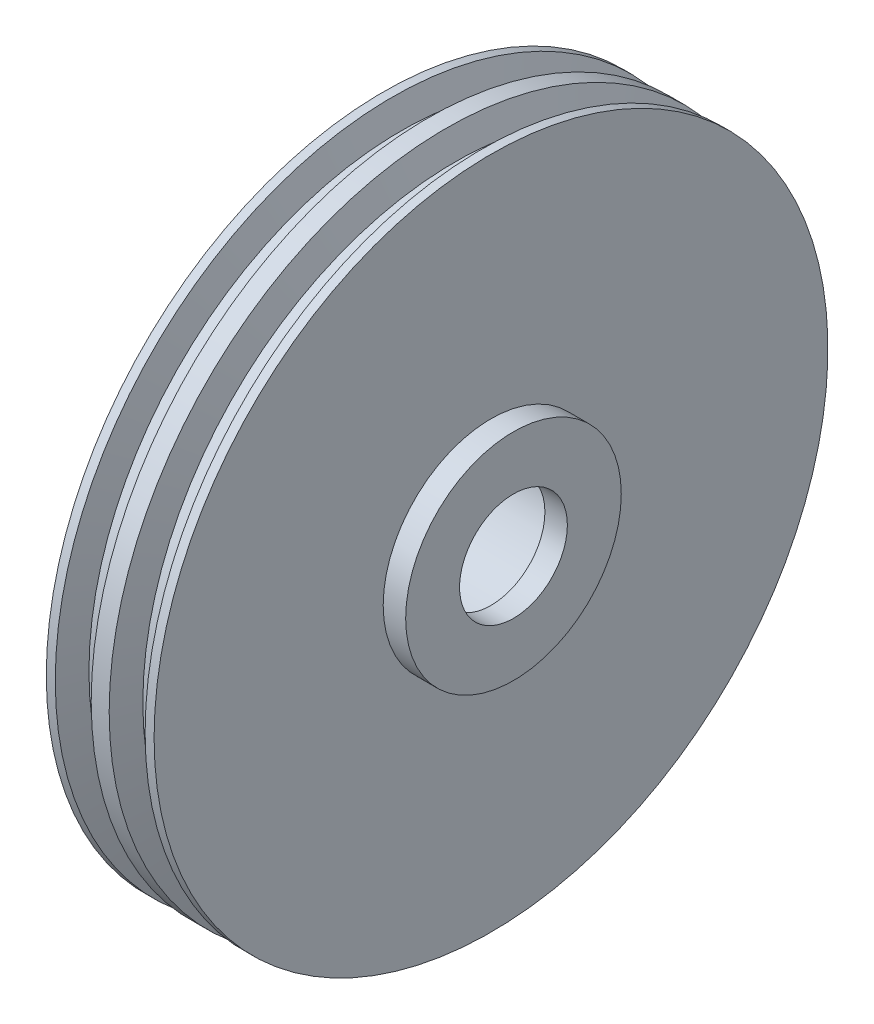
ISO-10303-21;
HEADER;
FILE_DESCRIPTION(('STEP AP214'),'2;1');
FILE_NAME('part.step','',(''),(''),'','','');
FILE_SCHEMA(('AUTOMOTIVE_DESIGN { 1 0 10303 214 1 1 1 1 }'));
ENDSEC;
DATA;
#1=APPLICATION_CONTEXT('core data for automotive mechanical design processes');
#2=APPLICATION_PROTOCOL_DEFINITION('international standard','automotive_design',2000,#1);
#3=PRODUCT_CONTEXT('',#1,'mechanical');
#4=PRODUCT('Part','Part','',(#3));
#5=PRODUCT_RELATED_PRODUCT_CATEGORY('part','',(#4));
#6=PRODUCT_DEFINITION_FORMATION('','',#4);
#7=PRODUCT_DEFINITION_CONTEXT('part definition',#1,'design');
#8=PRODUCT_DEFINITION('design','',#6,#7);
#9=PRODUCT_DEFINITION_SHAPE('','',#8);
#10=(LENGTH_UNIT() NAMED_UNIT(*) SI_UNIT(.MILLI.,.METRE.));
#11=(NAMED_UNIT(*) PLANE_ANGLE_UNIT() SI_UNIT($,.RADIAN.));
#12=(NAMED_UNIT(*) SI_UNIT($,.STERADIAN.) SOLID_ANGLE_UNIT());
#13=UNCERTAINTY_MEASURE_WITH_UNIT(LENGTH_MEASURE(1.E-05),#10,'distance_accuracy_value','');
#14=(GEOMETRIC_REPRESENTATION_CONTEXT(3) GLOBAL_UNCERTAINTY_ASSIGNED_CONTEXT((#13)) GLOBAL_UNIT_ASSIGNED_CONTEXT((#10,
#11,#12)) REPRESENTATION_CONTEXT('',''));
#15=CARTESIAN_POINT('',(0.,0.,0.));
#16=DIRECTION('',(0.,0.,1.));
#17=DIRECTION('',(1.,0.,0.));
#18=AXIS2_PLACEMENT_3D('',#15,#16,#17);
#19=CARTESIAN_POINT('',(0.,0.,0.));
#20=DIRECTION('',(-1.,0.,0.));
#21=DIRECTION('',(0.,0.,1.));
#22=AXIS2_PLACEMENT_3D('',#19,#20,#21);
#23=CYLINDRICAL_SURFACE('',#22,37.5);
#24=CARTESIAN_POINT('',(1.,0.,0.));
#25=DIRECTION('',(-1.,0.,0.));
#26=DIRECTION('',(0.,0.,1.));
#27=AXIS2_PLACEMENT_3D('',#24,#25,#26);
#28=CIRCLE('',#27,37.5);
#29=CARTESIAN_POINT('',(1.,0.,37.5));
#30=VERTEX_POINT('',#29);
#31=EDGE_CURVE('E37',#30,#30,#28,.T.);
#32=ORIENTED_EDGE('',*,*,#31,.T.);
#33=EDGE_LOOP('',(#32));
#34=FACE_BOUND('',#33,.T.);
#35=CARTESIAN_POINT('',(-1.,0.,0.));
#36=DIRECTION('',(-1.,0.,0.));
#37=DIRECTION('',(0.,0.,1.));
#38=AXIS2_PLACEMENT_3D('',#35,#36,#37);
#39=CIRCLE('',#38,37.5);
#40=CARTESIAN_POINT('',(-1.,0.,37.5));
#41=VERTEX_POINT('',#40);
#42=EDGE_CURVE('E71',#41,#41,#39,.T.);
#43=ORIENTED_EDGE('',*,*,#42,.F.);
#44=EDGE_LOOP('',(#43));
#45=FACE_BOUND('',#44,.T.);
#46=ADVANCED_FACE('F31',(#34,#45),#23,.T.);
#47=CARTESIAN_POINT('',(2.,0.,0.));
#48=DIRECTION('',(-1.,0.,0.));
#49=DIRECTION('',(0.,0.,1.));
#50=AXIS2_PLACEMENT_3D('',#47,#48,#49);
#51=CONICAL_SURFACE('',#50,34.7525225805454,1.22173047639603);
#52=ORIENTED_EDGE('',*,*,#31,.F.);
#53=EDGE_LOOP('',(#52));
#54=FACE_BOUND('',#53,.T.);
#55=CARTESIAN_POINT('',(2.,0.,0.));
#56=DIRECTION('',(-1.,0.,0.));
#57=DIRECTION('',(0.,0.,1.));
#58=AXIS2_PLACEMENT_3D('',#55,#56,#57);
#59=CIRCLE('',#58,34.7525225805454);
#60=CARTESIAN_POINT('',(2.,0.,34.7525225805454));
#61=VERTEX_POINT('',#60);
#62=EDGE_CURVE('E41',#61,#61,#59,.T.);
#63=ORIENTED_EDGE('',*,*,#62,.T.);
#64=EDGE_LOOP('',(#63));
#65=FACE_BOUND('',#64,.T.);
#66=ADVANCED_FACE('F134',(#54,#65),#51,.T.);
#67=CARTESIAN_POINT('',(0.,0.,0.));
#68=DIRECTION('',(-1.,0.,0.));
#69=DIRECTION('',(0.,0.,1.));
#70=AXIS2_PLACEMENT_3D('',#67,#68,#69);
#71=CYLINDRICAL_SURFACE('',#70,34.7525225805454);
#72=ORIENTED_EDGE('',*,*,#62,.F.);
#73=EDGE_LOOP('',(#72));
#74=FACE_BOUND('',#73,.T.);
#75=CARTESIAN_POINT('',(4.,0.,0.));
#76=DIRECTION('',(-1.,0.,0.));
#77=DIRECTION('',(0.,0.,1.));
#78=AXIS2_PLACEMENT_3D('',#75,#76,#77);
#79=CIRCLE('',#78,34.7525225805454);
#80=CARTESIAN_POINT('',(4.,0.,34.7525225805454));
#81=VERTEX_POINT('',#80);
#82=EDGE_CURVE('E45',#81,#81,#79,.T.);
#83=ORIENTED_EDGE('',*,*,#82,.T.);
#84=EDGE_LOOP('',(#83));
#85=FACE_BOUND('',#84,.T.);
#86=ADVANCED_FACE('F138',(#74,#85),#71,.T.);
#87=CARTESIAN_POINT('',(5.,0.,0.));
#88=DIRECTION('',(1.,0.,0.));
#89=DIRECTION('',(0.,0.,-1.));
#90=AXIS2_PLACEMENT_3D('',#87,#88,#89);
#91=CONICAL_SURFACE('',#90,37.5,1.22173047639603);
#92=ORIENTED_EDGE('',*,*,#82,.F.);
#93=EDGE_LOOP('',(#92));
#94=FACE_BOUND('',#93,.T.);
#95=CARTESIAN_POINT('',(5.,0.,0.));
#96=DIRECTION('',(-1.,0.,0.));
#97=DIRECTION('',(0.,0.,1.));
#98=AXIS2_PLACEMENT_3D('',#95,#96,#97);
#99=CIRCLE('',#98,37.5);
#100=CARTESIAN_POINT('',(5.,0.,37.5));
#101=VERTEX_POINT('',#100);
#102=EDGE_CURVE('E50',#101,#101,#99,.T.);
#103=ORIENTED_EDGE('',*,*,#102,.T.);
#104=EDGE_LOOP('',(#103));
#105=FACE_BOUND('',#104,.T.);
#106=ADVANCED_FACE('F288',(#94,#105),#91,.T.);
#107=CARTESIAN_POINT('',(0.,0.,0.));
#108=DIRECTION('',(-1.,0.,0.));
#109=DIRECTION('',(0.,0.,1.));
#110=AXIS2_PLACEMENT_3D('',#107,#108,#109);
#111=CYLINDRICAL_SURFACE('',#110,37.5);
#112=ORIENTED_EDGE('',*,*,#102,.F.);
#113=EDGE_LOOP('',(#112));
#114=FACE_BOUND('',#113,.T.);
#115=CARTESIAN_POINT('',(6.,0.,0.));
#116=DIRECTION('',(-1.,0.,0.));
#117=DIRECTION('',(0.,0.,1.));
#118=AXIS2_PLACEMENT_3D('',#115,#116,#117);
#119=CIRCLE('',#118,37.5);
#120=CARTESIAN_POINT('',(6.,0.,37.5));
#121=VERTEX_POINT('',#120);
#122=EDGE_CURVE('E53',#121,#121,#119,.T.);
#123=ORIENTED_EDGE('',*,*,#122,.T.);
#124=EDGE_LOOP('',(#123));
#125=FACE_BOUND('',#124,.T.);
#126=ADVANCED_FACE('F128',(#114,#125),#111,.T.);
#127=CARTESIAN_POINT('',(6.,37.5,0.));
#128=DIRECTION('',(-1.,0.,0.));
#129=DIRECTION('',(0.,0.,1.));
#130=AXIS2_PLACEMENT_3D('',#127,#128,#129);
#131=PLANE('',#130);
#132=CARTESIAN_POINT('',(6.,0.,0.));
#133=DIRECTION('',(-1.,0.,0.));
#134=DIRECTION('',(0.,0.,1.));
#135=AXIS2_PLACEMENT_3D('',#132,#133,#134);
#136=CIRCLE('',#135,12.);
#137=CARTESIAN_POINT('',(6.,0.,12.));
#138=VERTEX_POINT('',#137);
#139=EDGE_CURVE('E10',#138,#138,#136,.F.);
#140=ORIENTED_EDGE('',*,*,#139,.F.);
#141=EDGE_LOOP('',(#140));
#142=FACE_BOUND('',#141,.T.);
#143=ORIENTED_EDGE('',*,*,#122,.F.);
#144=EDGE_LOOP('',(#143));
#145=FACE_BOUND('',#144,.T.);
#146=ADVANCED_FACE('F118',(#142,#145),#131,.F.);
#147=CARTESIAN_POINT('',(-56.,0.,0.));
#148=DIRECTION('',(1.,0.,0.));
#149=DIRECTION('',(0.,0.,-1.));
#150=AXIS2_PLACEMENT_3D('',#147,#148,#149);
#151=CYLINDRICAL_SURFACE('',#150,9.52900056981119);
#152=CARTESIAN_POINT('',(6.00000000000001,0.,0.));
#153=DIRECTION('',(1.,0.,0.));
#154=DIRECTION('',(0.,0.,-1.));
#155=AXIS2_PLACEMENT_3D('',#152,#153,#154);
#156=CIRCLE('',#155,9.52900056981119);
#157=CARTESIAN_POINT('',(6.00000000000001,0.,-9.52900056981119));
#158=VERTEX_POINT('',#157);
#159=EDGE_CURVE('E56',#158,#158,#156,.F.);
#160=ORIENTED_EDGE('',*,*,#159,.F.);
#161=EDGE_LOOP('',(#160));
#162=FACE_BOUND('',#161,.T.);
#163=CARTESIAN_POINT('',(-6.00000000000001,0.,0.));
#164=DIRECTION('',(1.,0.,0.));
#165=DIRECTION('',(0.,0.,-1.));
#166=AXIS2_PLACEMENT_3D('',#163,#164,#165);
#167=CIRCLE('',#166,9.52900056981119);
#168=CARTESIAN_POINT('',(-6.00000000000001,0.,-9.52900056981119));
#169=VERTEX_POINT('',#168);
#170=EDGE_CURVE('E86',#169,#169,#167,.F.);
#171=ORIENTED_EDGE('',*,*,#170,.T.);
#172=EDGE_LOOP('',(#171));
#173=FACE_BOUND('',#172,.T.);
#174=ADVANCED_FACE('F115',(#162,#173),#151,.F.);
#175=CARTESIAN_POINT('',(6.,0.,0.));
#176=DIRECTION('',(1.,0.,0.));
#177=DIRECTION('',(0.,0.,-1.));
#178=AXIS2_PLACEMENT_3D('',#175,#176,#177);
#179=PLANE('',#178);
#180=CARTESIAN_POINT('',(6.,0.,0.));
#181=DIRECTION('',(1.,0.,0.));
#182=DIRECTION('',(0.,0.,-1.));
#183=AXIS2_PLACEMENT_3D('',#180,#181,#182);
#184=CIRCLE('',#183,6.);
#185=CARTESIAN_POINT('',(6.,0.,-6.));
#186=VERTEX_POINT('',#185);
#187=EDGE_CURVE('E63',#186,#186,#184,.T.);
#188=ORIENTED_EDGE('',*,*,#187,.T.);
#189=EDGE_LOOP('',(#188));
#190=FACE_BOUND('',#189,.T.);
#191=ORIENTED_EDGE('',*,*,#159,.T.);
#192=EDGE_LOOP('',(#191));
#193=FACE_BOUND('',#192,.T.);
#194=ADVANCED_FACE('F117',(#190,#193),#179,.F.);
#195=CARTESIAN_POINT('',(8.5,0.,0.));
#196=DIRECTION('',(1.,0.,0.));
#197=DIRECTION('',(0.,0.,-1.));
#198=AXIS2_PLACEMENT_3D('',#195,#196,#197);
#199=PLANE('',#198);
#200=CARTESIAN_POINT('',(8.5,0.,0.));
#201=DIRECTION('',(1.,0.,0.));
#202=DIRECTION('',(0.,0.,-1.));
#203=AXIS2_PLACEMENT_3D('',#200,#201,#202);
#204=CIRCLE('',#203,12.);
#205=CARTESIAN_POINT('',(8.5,0.,-12.));
#206=VERTEX_POINT('',#205);
#207=EDGE_CURVE('E59',#206,#206,#204,.T.);
#208=ORIENTED_EDGE('',*,*,#207,.T.);
#209=EDGE_LOOP('',(#208));
#210=FACE_BOUND('',#209,.T.);
#211=CARTESIAN_POINT('',(8.5,0.,0.));
#212=DIRECTION('',(1.,0.,0.));
#213=DIRECTION('',(0.,0.,-1.));
#214=AXIS2_PLACEMENT_3D('',#211,#212,#213);
#215=CIRCLE('',#214,6.);
#216=CARTESIAN_POINT('',(8.5,0.,-6.));
#217=VERTEX_POINT('',#216);
#218=EDGE_CURVE('E62',#217,#217,#215,.T.);
#219=ORIENTED_EDGE('',*,*,#218,.F.);
#220=EDGE_LOOP('',(#219));
#221=FACE_BOUND('',#220,.T.);
#222=ADVANCED_FACE('F125',(#210,#221),#199,.T.);
#223=CARTESIAN_POINT('',(8.5,0.,0.));
#224=DIRECTION('',(-1.,0.,0.));
#225=DIRECTION('',(0.,0.,1.));
#226=AXIS2_PLACEMENT_3D('',#223,#224,#225);
#227=CYLINDRICAL_SURFACE('',#226,12.);
#228=ORIENTED_EDGE('',*,*,#207,.F.);
#229=EDGE_LOOP('',(#228));
#230=FACE_BOUND('',#229,.T.);
#231=ORIENTED_EDGE('',*,*,#139,.T.);
#232=EDGE_LOOP('',(#231));
#233=FACE_BOUND('',#232,.T.);
#234=ADVANCED_FACE('F177',(#230,#233),#227,.T.);
#235=CARTESIAN_POINT('',(8.5,0.,0.));
#236=DIRECTION('',(-1.,0.,0.));
#237=DIRECTION('',(0.,0.,1.));
#238=AXIS2_PLACEMENT_3D('',#235,#236,#237);
#239=CYLINDRICAL_SURFACE('',#238,6.);
#240=ORIENTED_EDGE('',*,*,#218,.T.);
#241=EDGE_LOOP('',(#240));
#242=FACE_BOUND('',#241,.T.);
#243=ORIENTED_EDGE('',*,*,#187,.F.);
#244=EDGE_LOOP('',(#243));
#245=FACE_BOUND('',#244,.T.);
#246=ADVANCED_FACE('F147',(#242,#245),#239,.F.);
#247=CARTESIAN_POINT('',(-2.,0.,0.));
#248=DIRECTION('',(1.,0.,0.));
#249=DIRECTION('',(0.,0.,1.));
#250=AXIS2_PLACEMENT_3D('',#247,#248,#249);
#251=CONICAL_SURFACE('',#250,34.7525225805454,1.22173047639603);
#252=ORIENTED_EDGE('',*,*,#42,.T.);
#253=EDGE_LOOP('',(#252));
#254=FACE_BOUND('',#253,.T.);
#255=CARTESIAN_POINT('',(-2.,0.,0.));
#256=DIRECTION('',(-1.,0.,0.));
#257=DIRECTION('',(0.,0.,1.));
#258=AXIS2_PLACEMENT_3D('',#255,#256,#257);
#259=CIRCLE('',#258,34.7525225805454);
#260=CARTESIAN_POINT('',(-2.,0.,34.7525225805454));
#261=VERTEX_POINT('',#260);
#262=EDGE_CURVE('E74',#261,#261,#259,.T.);
#263=ORIENTED_EDGE('',*,*,#262,.F.);
#264=EDGE_LOOP('',(#263));
#265=FACE_BOUND('',#264,.T.);
#266=ADVANCED_FACE('F143',(#254,#265),#251,.T.);
#267=CARTESIAN_POINT('',(0.,0.,0.));
#268=DIRECTION('',(1.,0.,0.));
#269=DIRECTION('',(0.,0.,1.));
#270=AXIS2_PLACEMENT_3D('',#267,#268,#269);
#271=CYLINDRICAL_SURFACE('',#270,34.7525225805454);
#272=ORIENTED_EDGE('',*,*,#262,.T.);
#273=EDGE_LOOP('',(#272));
#274=FACE_BOUND('',#273,.T.);
#275=CARTESIAN_POINT('',(-4.,0.,0.));
#276=DIRECTION('',(-1.,0.,0.));
#277=DIRECTION('',(0.,0.,1.));
#278=AXIS2_PLACEMENT_3D('',#275,#276,#277);
#279=CIRCLE('',#278,34.7525225805454);
#280=CARTESIAN_POINT('',(-4.,0.,34.7525225805454));
#281=VERTEX_POINT('',#280);
#282=EDGE_CURVE('E77',#281,#281,#279,.T.);
#283=ORIENTED_EDGE('',*,*,#282,.F.);
#284=EDGE_LOOP('',(#283));
#285=FACE_BOUND('',#284,.T.);
#286=ADVANCED_FACE('F146',(#274,#285),#271,.T.);
#287=CARTESIAN_POINT('',(-5.,0.,0.));
#288=DIRECTION('',(-1.,0.,0.));
#289=DIRECTION('',(0.,0.,-1.));
#290=AXIS2_PLACEMENT_3D('',#287,#288,#289);
#291=CONICAL_SURFACE('',#290,37.5,1.22173047639603);
#292=ORIENTED_EDGE('',*,*,#282,.T.);
#293=EDGE_LOOP('',(#292));
#294=FACE_BOUND('',#293,.T.);
#295=CARTESIAN_POINT('',(-5.,0.,0.));
#296=DIRECTION('',(-1.,0.,0.));
#297=DIRECTION('',(0.,0.,1.));
#298=AXIS2_PLACEMENT_3D('',#295,#296,#297);
#299=CIRCLE('',#298,37.5);
#300=CARTESIAN_POINT('',(-5.,0.,37.5));
#301=VERTEX_POINT('',#300);
#302=EDGE_CURVE('E80',#301,#301,#299,.T.);
#303=ORIENTED_EDGE('',*,*,#302,.F.);
#304=EDGE_LOOP('',(#303));
#305=FACE_BOUND('',#304,.T.);
#306=ADVANCED_FACE('F153',(#294,#305),#291,.T.);
#307=CARTESIAN_POINT('',(0.,0.,0.));
#308=DIRECTION('',(1.,0.,0.));
#309=DIRECTION('',(0.,0.,1.));
#310=AXIS2_PLACEMENT_3D('',#307,#308,#309);
#311=CYLINDRICAL_SURFACE('',#310,37.5);
#312=ORIENTED_EDGE('',*,*,#302,.T.);
#313=EDGE_LOOP('',(#312));
#314=FACE_BOUND('',#313,.T.);
#315=CARTESIAN_POINT('',(-6.,0.,0.));
#316=DIRECTION('',(-1.,0.,0.));
#317=DIRECTION('',(0.,0.,1.));
#318=AXIS2_PLACEMENT_3D('',#315,#316,#317);
#319=CIRCLE('',#318,37.5);
#320=CARTESIAN_POINT('',(-6.,0.,37.5));
#321=VERTEX_POINT('',#320);
#322=EDGE_CURVE('E83',#321,#321,#319,.T.);
#323=ORIENTED_EDGE('',*,*,#322,.F.);
#324=EDGE_LOOP('',(#323));
#325=FACE_BOUND('',#324,.T.);
#326=ADVANCED_FACE('F159',(#314,#325),#311,.T.);
#327=CARTESIAN_POINT('',(-6.,37.5,0.));
#328=DIRECTION('',(1.,0.,0.));
#329=DIRECTION('',(0.,0.,1.));
#330=AXIS2_PLACEMENT_3D('',#327,#328,#329);
#331=PLANE('',#330);
#332=CARTESIAN_POINT('',(-6.,0.,0.));
#333=DIRECTION('',(-1.,0.,0.));
#334=DIRECTION('',(0.,0.,1.));
#335=AXIS2_PLACEMENT_3D('',#332,#333,#334);
#336=CIRCLE('',#335,12.);
#337=CARTESIAN_POINT('',(-6.,0.,12.));
#338=VERTEX_POINT('',#337);
#339=EDGE_CURVE('E66',#338,#338,#336,.F.);
#340=ORIENTED_EDGE('',*,*,#339,.T.);
#341=EDGE_LOOP('',(#340));
#342=FACE_BOUND('',#341,.T.);
#343=ORIENTED_EDGE('',*,*,#322,.T.);
#344=EDGE_LOOP('',(#343));
#345=FACE_BOUND('',#344,.T.);
#346=ADVANCED_FACE('F111',(#342,#345),#331,.F.);
#347=CARTESIAN_POINT('',(-6.,0.,0.));
#348=DIRECTION('',(-1.,0.,0.));
#349=DIRECTION('',(0.,0.,-1.));
#350=AXIS2_PLACEMENT_3D('',#347,#348,#349);
#351=PLANE('',#350);
#352=CARTESIAN_POINT('',(-6.,0.,0.));
#353=DIRECTION('',(1.,0.,0.));
#354=DIRECTION('',(0.,0.,-1.));
#355=AXIS2_PLACEMENT_3D('',#352,#353,#354);
#356=CIRCLE('',#355,6.);
#357=CARTESIAN_POINT('',(-6.,0.,-6.));
#358=VERTEX_POINT('',#357);
#359=EDGE_CURVE('E93',#358,#358,#356,.T.);
#360=ORIENTED_EDGE('',*,*,#359,.F.);
#361=EDGE_LOOP('',(#360));
#362=FACE_BOUND('',#361,.T.);
#363=ORIENTED_EDGE('',*,*,#170,.F.);
#364=EDGE_LOOP('',(#363));
#365=FACE_BOUND('',#364,.T.);
#366=ADVANCED_FACE('F108',(#362,#365),#351,.F.);
#367=CARTESIAN_POINT('',(-8.5,0.,0.));
#368=DIRECTION('',(-1.,0.,0.));
#369=DIRECTION('',(0.,0.,-1.));
#370=AXIS2_PLACEMENT_3D('',#367,#368,#369);
#371=PLANE('',#370);
#372=CARTESIAN_POINT('',(-8.5,0.,0.));
#373=DIRECTION('',(1.,0.,0.));
#374=DIRECTION('',(0.,0.,-1.));
#375=AXIS2_PLACEMENT_3D('',#372,#373,#374);
#376=CIRCLE('',#375,12.);
#377=CARTESIAN_POINT('',(-8.5,0.,-12.));
#378=VERTEX_POINT('',#377);
#379=EDGE_CURVE('E89',#378,#378,#376,.T.);
#380=ORIENTED_EDGE('',*,*,#379,.F.);
#381=EDGE_LOOP('',(#380));
#382=FACE_BOUND('',#381,.T.);
#383=CARTESIAN_POINT('',(-8.5,0.,0.));
#384=DIRECTION('',(1.,0.,0.));
#385=DIRECTION('',(0.,0.,-1.));
#386=AXIS2_PLACEMENT_3D('',#383,#384,#385);
#387=CIRCLE('',#386,6.);
#388=CARTESIAN_POINT('',(-8.5,0.,-6.));
#389=VERTEX_POINT('',#388);
#390=EDGE_CURVE('E92',#389,#389,#387,.T.);
#391=ORIENTED_EDGE('',*,*,#390,.T.);
#392=EDGE_LOOP('',(#391));
#393=FACE_BOUND('',#392,.T.);
#394=ADVANCED_FACE('F99',(#382,#393),#371,.T.);
#395=CARTESIAN_POINT('',(-8.5,0.,0.));
#396=DIRECTION('',(1.,0.,0.));
#397=DIRECTION('',(0.,0.,1.));
#398=AXIS2_PLACEMENT_3D('',#395,#396,#397);
#399=CYLINDRICAL_SURFACE('',#398,12.);
#400=ORIENTED_EDGE('',*,*,#379,.T.);
#401=EDGE_LOOP('',(#400));
#402=FACE_BOUND('',#401,.T.);
#403=ORIENTED_EDGE('',*,*,#339,.F.);
#404=EDGE_LOOP('',(#403));
#405=FACE_BOUND('',#404,.T.);
#406=ADVANCED_FACE('F104',(#402,#405),#399,.T.);
#407=CARTESIAN_POINT('',(-8.5,0.,0.));
#408=DIRECTION('',(1.,0.,0.));
#409=DIRECTION('',(0.,0.,1.));
#410=AXIS2_PLACEMENT_3D('',#407,#408,#409);
#411=CYLINDRICAL_SURFACE('',#410,6.);
#412=ORIENTED_EDGE('',*,*,#390,.F.);
#413=EDGE_LOOP('',(#412));
#414=FACE_BOUND('',#413,.T.);
#415=ORIENTED_EDGE('',*,*,#359,.T.);
#416=EDGE_LOOP('',(#415));
#417=FACE_BOUND('',#416,.T.);
#418=ADVANCED_FACE('F101',(#414,#417),#411,.F.);
#419=CLOSED_SHELL('',(#46,#66,#86,#106,#126,#146,#174,#194,#222,#234,#246,#266,#286,#306,#326,
#346,#366,#394,#406,#418));
#420=MANIFOLD_SOLID_BREP('B2',#419);
#421=ADVANCED_BREP_SHAPE_REPRESENTATION('',(#18,#420),#14);
#422=SHAPE_DEFINITION_REPRESENTATION(#9,#421);
ENDSEC;
END-ISO-10303-21;
